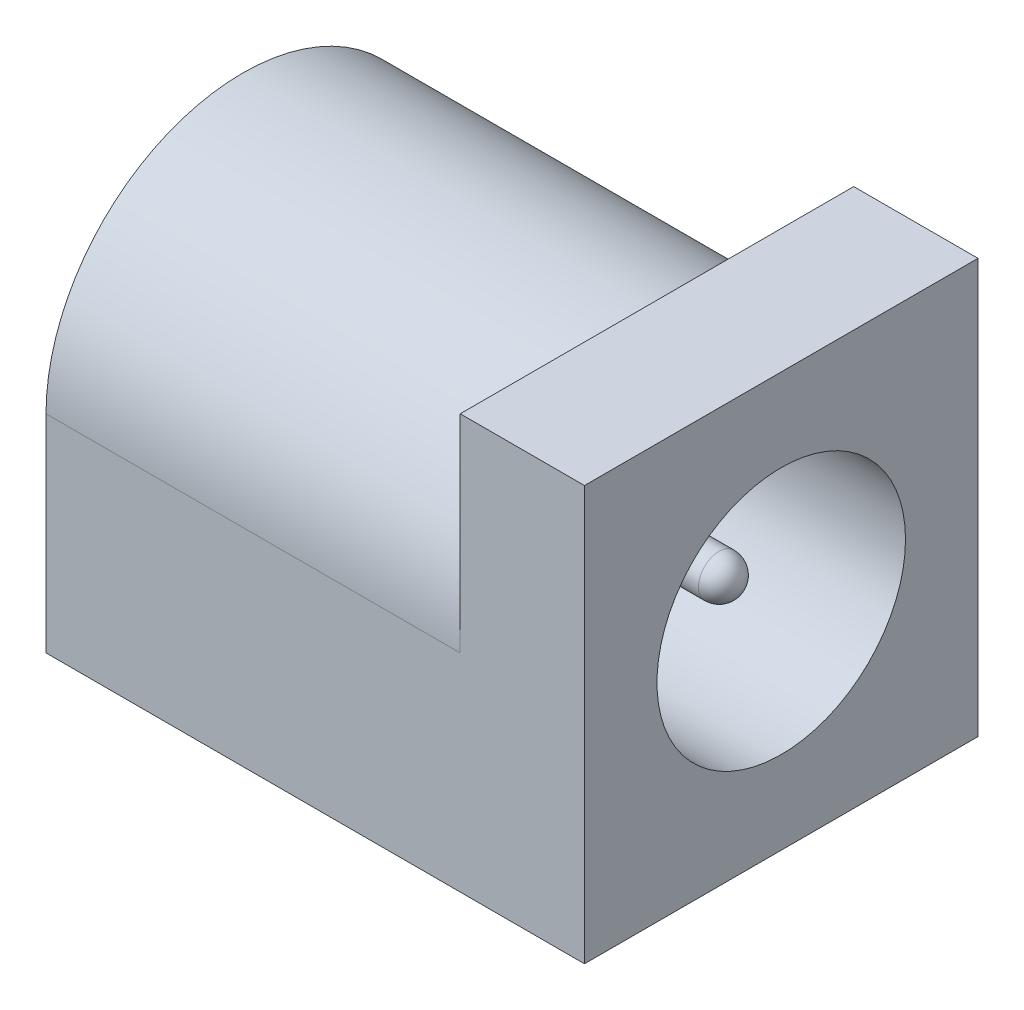
ISO-10303-21;
HEADER;
FILE_DESCRIPTION(('STEP AP214'),'2;1');
FILE_NAME('part.step','',(''),(''),'','','');
FILE_SCHEMA(('AUTOMOTIVE_DESIGN { 1 0 10303 214 1 1 1 1 }'));
ENDSEC;
DATA;
#1=APPLICATION_CONTEXT('core data for automotive mechanical design processes');
#2=APPLICATION_PROTOCOL_DEFINITION('international standard','automotive_design',2000,#1);
#3=PRODUCT_CONTEXT('',#1,'mechanical');
#4=PRODUCT('Part','Part','',(#3));
#5=PRODUCT_RELATED_PRODUCT_CATEGORY('part','',(#4));
#6=PRODUCT_DEFINITION_FORMATION('','',#4);
#7=PRODUCT_DEFINITION_CONTEXT('part definition',#1,'design');
#8=PRODUCT_DEFINITION('design','',#6,#7);
#9=PRODUCT_DEFINITION_SHAPE('','',#8);
#10=(LENGTH_UNIT() NAMED_UNIT(*) SI_UNIT(.MILLI.,.METRE.));
#11=(NAMED_UNIT(*) PLANE_ANGLE_UNIT() SI_UNIT($,.RADIAN.));
#12=(NAMED_UNIT(*) SI_UNIT($,.STERADIAN.) SOLID_ANGLE_UNIT());
#13=UNCERTAINTY_MEASURE_WITH_UNIT(LENGTH_MEASURE(1.E-05),#10,'distance_accuracy_value','');
#14=(GEOMETRIC_REPRESENTATION_CONTEXT(3) GLOBAL_UNCERTAINTY_ASSIGNED_CONTEXT((#13)) GLOBAL_UNIT_ASSIGNED_CONTEXT((#10,
#11,#12)) REPRESENTATION_CONTEXT('',''));
#15=CARTESIAN_POINT('',(0.,0.,0.));
#16=DIRECTION('',(0.,0.,1.));
#17=DIRECTION('',(1.,0.,0.));
#18=AXIS2_PLACEMENT_3D('',#15,#16,#17);
#19=CARTESIAN_POINT('',(10.,2.5,0.));
#20=DIRECTION('',(-1.,0.,0.));
#21=DIRECTION('',(0.,0.,1.));
#22=AXIS2_PLACEMENT_3D('',#19,#20,#21);
#23=CYLINDRICAL_SURFACE('',#22,4.75);
#24=CARTESIAN_POINT('',(0.,2.5,0.));
#25=DIRECTION('',(1.,0.,0.));
#26=DIRECTION('',(0.,0.,1.));
#27=AXIS2_PLACEMENT_3D('',#24,#25,#26);
#28=CIRCLE('',#27,4.75);
#29=CARTESIAN_POINT('',(0.,2.5,-4.75));
#30=VERTEX_POINT('',#29);
#31=CARTESIAN_POINT('',(0.,2.5,4.75));
#32=VERTEX_POINT('',#31);
#33=EDGE_CURVE('E105',#30,#32,#28,.T.);
#34=ORIENTED_EDGE('',*,*,#33,.T.);
#35=DIRECTION('',(-1.,0.,0.));
#36=VECTOR('',#35,1.);
#37=CARTESIAN_POINT('',(10.,2.5,4.75));
#38=LINE('',#37,#36);
#39=CARTESIAN_POINT('',(10.,2.5,4.75));
#40=VERTEX_POINT('',#39);
#41=EDGE_CURVE('E58',#40,#32,#38,.T.);
#42=ORIENTED_EDGE('',*,*,#41,.F.);
#43=CARTESIAN_POINT('',(10.,2.5,0.));
#44=DIRECTION('',(1.,0.,0.));
#45=DIRECTION('',(0.,0.,1.));
#46=AXIS2_PLACEMENT_3D('',#43,#44,#45);
#47=CIRCLE('',#46,4.75);
#48=CARTESIAN_POINT('',(10.,2.5,-4.75));
#49=VERTEX_POINT('',#48);
#50=EDGE_CURVE('E106',#49,#40,#47,.T.);
#51=ORIENTED_EDGE('',*,*,#50,.F.);
#52=DIRECTION('',(-1.,0.,0.));
#53=VECTOR('',#52,1.);
#54=CARTESIAN_POINT('',(10.,2.5,-4.75));
#55=LINE('',#54,#53);
#56=EDGE_CURVE('E65',#49,#30,#55,.T.);
#57=ORIENTED_EDGE('',*,*,#56,.T.);
#58=EDGE_LOOP('',(#34,#42,#51,#57));
#59=FACE_BOUND('',#58,.T.);
#60=ADVANCED_FACE('F49',(#59),#23,.T.);
#61=CARTESIAN_POINT('',(10.,-2.5,4.75));
#62=DIRECTION('',(0.,0.,-1.));
#63=DIRECTION('',(-1.,0.,0.));
#64=AXIS2_PLACEMENT_3D('',#61,#62,#63);
#65=PLANE('',#64);
#66=DIRECTION('',(0.,-1.,0.));
#67=VECTOR('',#66,1.);
#68=CARTESIAN_POINT('',(0.,-2.5,4.75));
#69=LINE('',#68,#67);
#70=CARTESIAN_POINT('',(0.,-2.5,4.75));
#71=VERTEX_POINT('',#70);
#72=EDGE_CURVE('E94',#32,#71,#69,.T.);
#73=ORIENTED_EDGE('',*,*,#72,.T.);
#74=DIRECTION('',(-1.,0.,0.));
#75=VECTOR('',#74,1.);
#76=CARTESIAN_POINT('',(10.,-2.5,4.75));
#77=LINE('',#76,#75);
#78=CARTESIAN_POINT('',(13.,-2.5,4.75));
#79=VERTEX_POINT('',#78);
#80=EDGE_CURVE('E90',#79,#71,#77,.T.);
#81=ORIENTED_EDGE('',*,*,#80,.F.);
#82=DIRECTION('',(0.,-1.,0.));
#83=VECTOR('',#82,1.);
#84=CARTESIAN_POINT('',(13.,7.5,4.75));
#85=LINE('',#84,#83);
#86=CARTESIAN_POINT('',(13.,7.5,4.75));
#87=VERTEX_POINT('',#86);
#88=EDGE_CURVE('E133',#87,#79,#85,.T.);
#89=ORIENTED_EDGE('',*,*,#88,.F.);
#90=DIRECTION('',(-1.,0.,0.));
#91=VECTOR('',#90,1.);
#92=CARTESIAN_POINT('',(13.,7.5,4.75));
#93=LINE('',#92,#91);
#94=CARTESIAN_POINT('',(10.,7.5,4.75));
#95=VERTEX_POINT('',#94);
#96=EDGE_CURVE('E125',#87,#95,#93,.T.);
#97=ORIENTED_EDGE('',*,*,#96,.T.);
#98=DIRECTION('',(0.,-1.,0.));
#99=VECTOR('',#98,1.);
#100=CARTESIAN_POINT('',(10.,7.5,4.75));
#101=LINE('',#100,#99);
#102=EDGE_CURVE('E120',#95,#40,#101,.T.);
#103=ORIENTED_EDGE('',*,*,#102,.T.);
#104=ORIENTED_EDGE('',*,*,#41,.T.);
#105=EDGE_LOOP('',(#73,#81,#89,#97,#103,#104));
#106=FACE_BOUND('',#105,.T.);
#107=ADVANCED_FACE('F117',(#106),#65,.F.);
#108=CARTESIAN_POINT('',(10.,-2.5,4.75));
#109=DIRECTION('',(0.,1.,0.));
#110=DIRECTION('',(0.,0.,1.));
#111=AXIS2_PLACEMENT_3D('',#108,#109,#110);
#112=PLANE('',#111);
#113=DIRECTION('',(0.,0.,-1.));
#114=VECTOR('',#113,1.);
#115=CARTESIAN_POINT('',(0.,-2.5,4.75));
#116=LINE('',#115,#114);
#117=CARTESIAN_POINT('',(0.,-2.5,-4.75));
#118=VERTEX_POINT('',#117);
#119=EDGE_CURVE('E82',#71,#118,#116,.T.);
#120=ORIENTED_EDGE('',*,*,#119,.T.);
#121=DIRECTION('',(-1.,0.,0.));
#122=VECTOR('',#121,1.);
#123=CARTESIAN_POINT('',(10.,-2.5,-4.75));
#124=LINE('',#123,#122);
#125=CARTESIAN_POINT('',(13.,-2.5,-4.75));
#126=VERTEX_POINT('',#125);
#127=EDGE_CURVE('E87',#126,#118,#124,.T.);
#128=ORIENTED_EDGE('',*,*,#127,.F.);
#129=DIRECTION('',(0.,0.,-1.));
#130=VECTOR('',#129,1.);
#131=CARTESIAN_POINT('',(13.,-2.5,4.75));
#132=LINE('',#131,#130);
#133=EDGE_CURVE('E141',#79,#126,#132,.T.);
#134=ORIENTED_EDGE('',*,*,#133,.F.);
#135=ORIENTED_EDGE('',*,*,#80,.T.);
#136=EDGE_LOOP('',(#120,#128,#134,#135));
#137=FACE_BOUND('',#136,.T.);
#138=ADVANCED_FACE('F84',(#137),#112,.F.);
#139=CARTESIAN_POINT('',(10.,-2.5,-4.75));
#140=DIRECTION('',(0.,0.,1.));
#141=DIRECTION('',(1.,0.,0.));
#142=AXIS2_PLACEMENT_3D('',#139,#140,#141);
#143=PLANE('',#142);
#144=DIRECTION('',(0.,1.,0.));
#145=VECTOR('',#144,1.);
#146=CARTESIAN_POINT('',(0.,-2.5,-4.75));
#147=LINE('',#146,#145);
#148=EDGE_CURVE('E93',#118,#30,#147,.T.);
#149=ORIENTED_EDGE('',*,*,#148,.T.);
#150=ORIENTED_EDGE('',*,*,#56,.F.);
#151=DIRECTION('',(0.,1.,0.));
#152=VECTOR('',#151,1.);
#153=CARTESIAN_POINT('',(10.,7.5,-4.75));
#154=LINE('',#153,#152);
#155=CARTESIAN_POINT('',(10.,7.5,-4.75));
#156=VERTEX_POINT('',#155);
#157=EDGE_CURVE('E134',#49,#156,#154,.T.);
#158=ORIENTED_EDGE('',*,*,#157,.T.);
#159=DIRECTION('',(-1.,0.,0.));
#160=VECTOR('',#159,1.);
#161=CARTESIAN_POINT('',(13.,7.5,-4.75));
#162=LINE('',#161,#160);
#163=CARTESIAN_POINT('',(13.,7.5,-4.75));
#164=VERTEX_POINT('',#163);
#165=EDGE_CURVE('E122',#164,#156,#162,.T.);
#166=ORIENTED_EDGE('',*,*,#165,.F.);
#167=DIRECTION('',(0.,1.,0.));
#168=VECTOR('',#167,1.);
#169=CARTESIAN_POINT('',(13.,7.5,-4.75));
#170=LINE('',#169,#168);
#171=EDGE_CURVE('E100',#126,#164,#170,.T.);
#172=ORIENTED_EDGE('',*,*,#171,.F.);
#173=ORIENTED_EDGE('',*,*,#127,.T.);
#174=EDGE_LOOP('',(#149,#150,#158,#166,#172,#173));
#175=FACE_BOUND('',#174,.T.);
#176=ADVANCED_FACE('F97',(#175),#143,.F.);
#177=CARTESIAN_POINT('',(0.,2.5,0.));
#178=DIRECTION('',(-1.,0.,0.));
#179=DIRECTION('',(0.,0.,1.));
#180=AXIS2_PLACEMENT_3D('',#177,#178,#179);
#181=PLANE('',#180);
#182=ORIENTED_EDGE('',*,*,#33,.F.);
#183=ORIENTED_EDGE('',*,*,#148,.F.);
#184=ORIENTED_EDGE('',*,*,#119,.F.);
#185=ORIENTED_EDGE('',*,*,#72,.F.);
#186=EDGE_LOOP('',(#182,#183,#184,#185));
#187=FACE_BOUND('',#186,.T.);
#188=ADVANCED_FACE('F103',(#187),#181,.T.);
#189=CARTESIAN_POINT('',(13.,7.5,4.75));
#190=DIRECTION('',(0.,-1.,0.));
#191=DIRECTION('',(0.,0.,-1.));
#192=AXIS2_PLACEMENT_3D('',#189,#190,#191);
#193=PLANE('',#192);
#194=DIRECTION('',(0.,0.,1.));
#195=VECTOR('',#194,1.);
#196=CARTESIAN_POINT('',(10.,7.5,4.75));
#197=LINE('',#196,#195);
#198=EDGE_CURVE('E130',#156,#95,#197,.T.);
#199=ORIENTED_EDGE('',*,*,#198,.T.);
#200=ORIENTED_EDGE('',*,*,#96,.F.);
#201=DIRECTION('',(0.,0.,1.));
#202=VECTOR('',#201,1.);
#203=CARTESIAN_POINT('',(13.,7.5,4.75));
#204=LINE('',#203,#202);
#205=EDGE_CURVE('E129',#164,#87,#204,.T.);
#206=ORIENTED_EDGE('',*,*,#205,.F.);
#207=ORIENTED_EDGE('',*,*,#165,.T.);
#208=EDGE_LOOP('',(#199,#200,#206,#207));
#209=FACE_BOUND('',#208,.T.);
#210=ADVANCED_FACE('F172',(#209),#193,.F.);
#211=CARTESIAN_POINT('',(13.,0.,0.));
#212=DIRECTION('',(1.,0.,0.));
#213=DIRECTION('',(0.,0.,-1.));
#214=AXIS2_PLACEMENT_3D('',#211,#212,#213);
#215=PLANE('',#214);
#216=CARTESIAN_POINT('',(13.,2.5,0.));
#217=DIRECTION('',(1.,0.,0.));
#218=DIRECTION('',(0.,0.,-1.));
#219=AXIS2_PLACEMENT_3D('',#216,#217,#218);
#220=CIRCLE('',#219,3.);
#221=CARTESIAN_POINT('',(13.,2.5,-3.));
#222=VERTEX_POINT('',#221);
#223=EDGE_CURVE('E145',#222,#222,#220,.T.);
#224=ORIENTED_EDGE('',*,*,#223,.F.);
#225=EDGE_LOOP('',(#224));
#226=FACE_BOUND('',#225,.T.);
#227=ORIENTED_EDGE('',*,*,#88,.T.);
#228=ORIENTED_EDGE('',*,*,#133,.T.);
#229=ORIENTED_EDGE('',*,*,#171,.T.);
#230=ORIENTED_EDGE('',*,*,#205,.T.);
#231=EDGE_LOOP('',(#227,#228,#229,#230));
#232=FACE_BOUND('',#231,.T.);
#233=ADVANCED_FACE('F169',(#226,#232),#215,.T.);
#234=CARTESIAN_POINT('',(10.,0.,0.));
#235=DIRECTION('',(1.,0.,0.));
#236=DIRECTION('',(0.,0.,-1.));
#237=AXIS2_PLACEMENT_3D('',#234,#235,#236);
#238=PLANE('',#237);
#239=ORIENTED_EDGE('',*,*,#157,.F.);
#240=ORIENTED_EDGE('',*,*,#50,.T.);
#241=ORIENTED_EDGE('',*,*,#102,.F.);
#242=ORIENTED_EDGE('',*,*,#198,.F.);
#243=EDGE_LOOP('',(#239,#240,#241,#242));
#244=FACE_BOUND('',#243,.T.);
#245=ADVANCED_FACE('F165',(#244),#238,.F.);
#246=CARTESIAN_POINT('',(1.,2.5,0.));
#247=DIRECTION('',(1.,0.,0.));
#248=DIRECTION('',(0.,0.,-1.));
#249=AXIS2_PLACEMENT_3D('',#246,#247,#248);
#250=CYLINDRICAL_SURFACE('',#249,3.);
#251=CARTESIAN_POINT('',(1.,2.5,0.));
#252=DIRECTION('',(1.,0.,0.));
#253=DIRECTION('',(0.,0.,-1.));
#254=AXIS2_PLACEMENT_3D('',#251,#252,#253);
#255=CIRCLE('',#254,3.);
#256=CARTESIAN_POINT('',(1.,2.5,-3.));
#257=VERTEX_POINT('',#256);
#258=EDGE_CURVE('E137',#257,#257,#255,.T.);
#259=ORIENTED_EDGE('',*,*,#258,.F.);
#260=EDGE_LOOP('',(#259));
#261=FACE_BOUND('',#260,.T.);
#262=ORIENTED_EDGE('',*,*,#223,.T.);
#263=EDGE_LOOP('',(#262));
#264=FACE_BOUND('',#263,.T.);
#265=ADVANCED_FACE('F159',(#261,#264),#250,.F.);
#266=CARTESIAN_POINT('',(1.,2.5,0.));
#267=DIRECTION('',(1.,0.,0.));
#268=DIRECTION('',(0.,0.,-1.));
#269=AXIS2_PLACEMENT_3D('',#266,#267,#268);
#270=PLANE('',#269);
#271=CARTESIAN_POINT('',(1.,2.5,0.));
#272=DIRECTION('',(1.,0.,0.));
#273=DIRECTION('',(0.,0.,-1.));
#274=AXIS2_PLACEMENT_3D('',#271,#272,#273);
#275=CIRCLE('',#274,0.5);
#276=CARTESIAN_POINT('',(1.,2.5,-0.500000000000001));
#277=VERTEX_POINT('',#276);
#278=EDGE_CURVE('E148',#277,#277,#275,.T.);
#279=ORIENTED_EDGE('',*,*,#278,.F.);
#280=EDGE_LOOP('',(#279));
#281=FACE_BOUND('',#280,.T.);
#282=ORIENTED_EDGE('',*,*,#258,.T.);
#283=EDGE_LOOP('',(#282));
#284=FACE_BOUND('',#283,.T.);
#285=ADVANCED_FACE('F156',(#281,#284),#270,.T.);
#286=CARTESIAN_POINT('',(12.,2.5,0.));
#287=DIRECTION('',(-1.,0.,0.));
#288=DIRECTION('',(0.,0.,1.));
#289=AXIS2_PLACEMENT_3D('',#286,#287,#288);
#290=CYLINDRICAL_SURFACE('',#289,0.5);
#291=CARTESIAN_POINT('',(11.5,2.5,0.));
#292=DIRECTION('',(-1.,0.,0.));
#293=DIRECTION('',(0.,0.,1.));
#294=AXIS2_PLACEMENT_3D('',#291,#292,#293);
#295=CIRCLE('',#294,0.5);
#296=CARTESIAN_POINT('',(11.5,2.5,0.499999999999999));
#297=VERTEX_POINT('',#296);
#298=EDGE_CURVE('E11',#297,#297,#295,.T.);
#299=ORIENTED_EDGE('',*,*,#298,.T.);
#300=EDGE_LOOP('',(#299));
#301=FACE_BOUND('',#300,.T.);
#302=ORIENTED_EDGE('',*,*,#278,.T.);
#303=EDGE_LOOP('',(#302));
#304=FACE_BOUND('',#303,.T.);
#305=ADVANCED_FACE('F154',(#301,#304),#290,.T.);
#306=CARTESIAN_POINT('',(11.5,2.5,0.));
#307=DIRECTION('',(1.,0.,0.));
#308=DIRECTION('',(0.,0.,-1.));
#309=AXIS2_PLACEMENT_3D('',#306,#307,#308);
#310=SPHERICAL_SURFACE('',#309,0.5);
#311=ORIENTED_EDGE('',*,*,#298,.F.);
#312=EDGE_LOOP('',(#311));
#313=FACE_BOUND('',#312,.T.);
#314=ADVANCED_FACE('F51',(#313),#310,.T.);
#315=CLOSED_SHELL('',(#60,#107,#138,#176,#188,#210,#233,#245,#265,#285,#305,#314));
#316=MANIFOLD_SOLID_BREP('B2',#315);
#317=ADVANCED_BREP_SHAPE_REPRESENTATION('',(#18,#316),#14);
#318=SHAPE_DEFINITION_REPRESENTATION(#9,#317);
ENDSEC;
END-ISO-10303-21;
